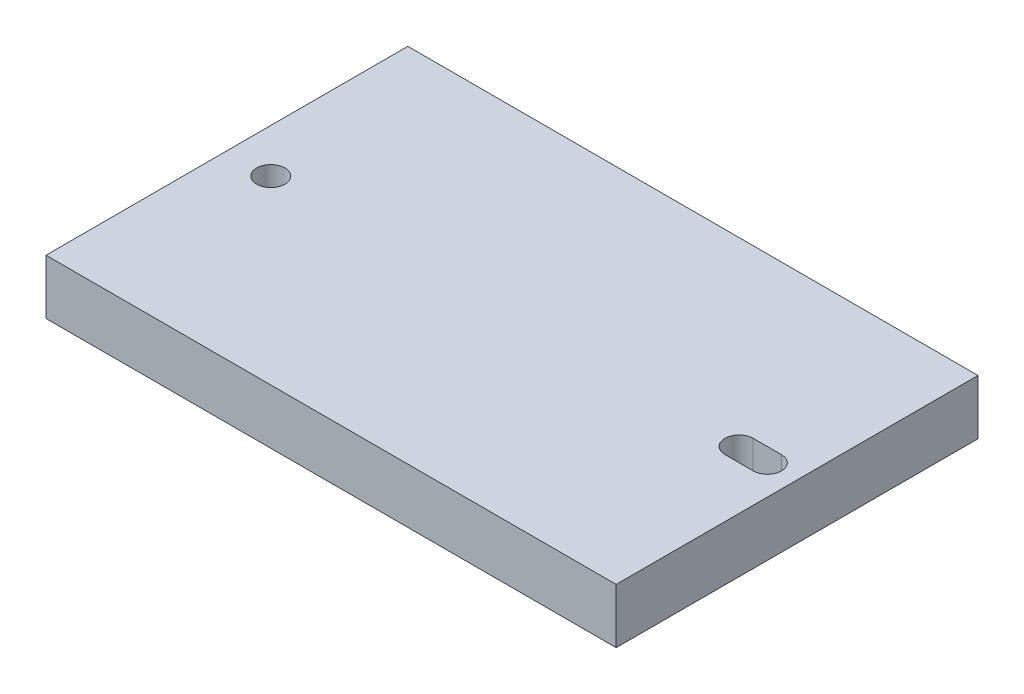
ISO-10303-21;
HEADER;
FILE_DESCRIPTION(('STEP AP214'),'2;1');
FILE_NAME('part.step','',(''),(''),'','','');
FILE_SCHEMA(('AUTOMOTIVE_DESIGN { 1 0 10303 214 1 1 1 1 }'));
ENDSEC;
DATA;
#1=APPLICATION_CONTEXT('core data for automotive mechanical design processes');
#2=APPLICATION_PROTOCOL_DEFINITION('international standard','automotive_design',2000,#1);
#3=PRODUCT_CONTEXT('',#1,'mechanical');
#4=PRODUCT('Part','Part','',(#3));
#5=PRODUCT_RELATED_PRODUCT_CATEGORY('part','',(#4));
#6=PRODUCT_DEFINITION_FORMATION('','',#4);
#7=PRODUCT_DEFINITION_CONTEXT('part definition',#1,'design');
#8=PRODUCT_DEFINITION('design','',#6,#7);
#9=PRODUCT_DEFINITION_SHAPE('','',#8);
#10=(LENGTH_UNIT() NAMED_UNIT(*) SI_UNIT(.MILLI.,.METRE.));
#11=(NAMED_UNIT(*) PLANE_ANGLE_UNIT() SI_UNIT($,.RADIAN.));
#12=(NAMED_UNIT(*) SI_UNIT($,.STERADIAN.) SOLID_ANGLE_UNIT());
#13=UNCERTAINTY_MEASURE_WITH_UNIT(LENGTH_MEASURE(1.E-05),#10,'distance_accuracy_value','');
#14=(GEOMETRIC_REPRESENTATION_CONTEXT(3) GLOBAL_UNCERTAINTY_ASSIGNED_CONTEXT((#13)) GLOBAL_UNIT_ASSIGNED_CONTEXT((#10,
#11,#12)) REPRESENTATION_CONTEXT('',''));
#15=CARTESIAN_POINT('',(0.,0.,0.));
#16=DIRECTION('',(0.,0.,1.));
#17=DIRECTION('',(1.,0.,0.));
#18=AXIS2_PLACEMENT_3D('',#15,#16,#17);
#19=CARTESIAN_POINT('',(-42.7686190505824,6.35,-22.2551637593528));
#20=DIRECTION('',(1.,0.,0.));
#21=DIRECTION('',(0.,0.,-1.));
#22=AXIS2_PLACEMENT_3D('',#19,#20,#21);
#23=PLANE('',#22);
#24=DIRECTION('',(0.,0.,1.));
#25=VECTOR('',#24,1.);
#26=CARTESIAN_POINT('',(-42.7686190505824,0.,-22.2551637593528));
#27=LINE('',#26,#25);
#28=CARTESIAN_POINT('',(-42.7686190505824,0.,-22.2551637593528));
#29=VERTEX_POINT('',#28);
#30=CARTESIAN_POINT('',(-42.7686190505824,0.,19.6548362406472));
#31=VERTEX_POINT('',#30);
#32=EDGE_CURVE('E148',#29,#31,#27,.T.);
#33=ORIENTED_EDGE('',*,*,#32,.T.);
#34=DIRECTION('',(0.,-1.,0.));
#35=VECTOR('',#34,1.);
#36=CARTESIAN_POINT('',(-42.7686190505824,6.35,19.6548362406472));
#37=LINE('',#36,#35);
#38=CARTESIAN_POINT('',(-42.7686190505824,6.35,19.6548362406472));
#39=VERTEX_POINT('',#38);
#40=EDGE_CURVE('E11',#39,#31,#37,.T.);
#41=ORIENTED_EDGE('',*,*,#40,.F.);
#42=DIRECTION('',(0.,0.,1.));
#43=VECTOR('',#42,1.);
#44=CARTESIAN_POINT('',(-42.7686190505824,6.35,-22.2551637593528));
#45=LINE('',#44,#43);
#46=CARTESIAN_POINT('',(-42.7686190505824,6.35,-22.2551637593528));
#47=VERTEX_POINT('',#46);
#48=EDGE_CURVE('E137',#47,#39,#45,.T.);
#49=ORIENTED_EDGE('',*,*,#48,.F.);
#50=DIRECTION('',(0.,-1.,0.));
#51=VECTOR('',#50,1.);
#52=CARTESIAN_POINT('',(-42.7686190505824,6.35,-22.2551637593528));
#53=LINE('',#52,#51);
#54=EDGE_CURVE('E147',#47,#29,#53,.T.);
#55=ORIENTED_EDGE('',*,*,#54,.T.);
#56=EDGE_LOOP('',(#33,#41,#49,#55));
#57=FACE_BOUND('',#56,.T.);
#58=ADVANCED_FACE('F33',(#57),#23,.F.);
#59=CARTESIAN_POINT('',(-42.7686190505824,6.35,19.6548362406472));
#60=DIRECTION('',(0.,0.,-1.));
#61=DIRECTION('',(-1.,0.,0.));
#62=AXIS2_PLACEMENT_3D('',#59,#60,#61);
#63=PLANE('',#62);
#64=DIRECTION('',(1.,0.,0.));
#65=VECTOR('',#64,1.);
#66=CARTESIAN_POINT('',(-42.7686190505824,0.,19.6548362406472));
#67=LINE('',#66,#65);
#68=CARTESIAN_POINT('',(23.2713809494176,0.,19.6548362406472));
#69=VERTEX_POINT('',#68);
#70=EDGE_CURVE('E151',#31,#69,#67,.T.);
#71=ORIENTED_EDGE('',*,*,#70,.T.);
#72=DIRECTION('',(0.,-1.,0.));
#73=VECTOR('',#72,1.);
#74=CARTESIAN_POINT('',(23.2713809494176,6.35,19.6548362406472));
#75=LINE('',#74,#73);
#76=CARTESIAN_POINT('',(23.2713809494176,6.35,19.6548362406472));
#77=VERTEX_POINT('',#76);
#78=EDGE_CURVE('E41',#77,#69,#75,.T.);
#79=ORIENTED_EDGE('',*,*,#78,.F.);
#80=DIRECTION('',(1.,0.,0.));
#81=VECTOR('',#80,1.);
#82=CARTESIAN_POINT('',(-42.7686190505824,6.35,19.6548362406472));
#83=LINE('',#82,#81);
#84=EDGE_CURVE('E140',#39,#77,#83,.T.);
#85=ORIENTED_EDGE('',*,*,#84,.F.);
#86=ORIENTED_EDGE('',*,*,#40,.T.);
#87=EDGE_LOOP('',(#71,#79,#85,#86));
#88=FACE_BOUND('',#87,.T.);
#89=ADVANCED_FACE('F181',(#88),#63,.F.);
#90=CARTESIAN_POINT('',(23.2713809494176,6.35,-22.2551637593528));
#91=DIRECTION('',(-1.,0.,0.));
#92=DIRECTION('',(0.,0.,1.));
#93=AXIS2_PLACEMENT_3D('',#90,#91,#92);
#94=PLANE('',#93);
#95=DIRECTION('',(0.,0.,-1.));
#96=VECTOR('',#95,1.);
#97=CARTESIAN_POINT('',(23.2713809494176,0.,-22.2551637593528));
#98=LINE('',#97,#96);
#99=CARTESIAN_POINT('',(23.2713809494176,0.,-22.2551637593528));
#100=VERTEX_POINT('',#99);
#101=EDGE_CURVE('E153',#69,#100,#98,.T.);
#102=ORIENTED_EDGE('',*,*,#101,.T.);
#103=DIRECTION('',(0.,-1.,0.));
#104=VECTOR('',#103,1.);
#105=CARTESIAN_POINT('',(23.2713809494176,6.35,-22.2551637593528));
#106=LINE('',#105,#104);
#107=CARTESIAN_POINT('',(23.2713809494176,6.35,-22.2551637593528));
#108=VERTEX_POINT('',#107);
#109=EDGE_CURVE('E158',#108,#100,#106,.T.);
#110=ORIENTED_EDGE('',*,*,#109,.F.);
#111=DIRECTION('',(0.,0.,-1.));
#112=VECTOR('',#111,1.);
#113=CARTESIAN_POINT('',(23.2713809494176,6.35,-22.2551637593528));
#114=LINE('',#113,#112);
#115=EDGE_CURVE('E143',#77,#108,#114,.T.);
#116=ORIENTED_EDGE('',*,*,#115,.F.);
#117=ORIENTED_EDGE('',*,*,#78,.T.);
#118=EDGE_LOOP('',(#102,#110,#116,#117));
#119=FACE_BOUND('',#118,.T.);
#120=ADVANCED_FACE('F166',(#119),#94,.F.);
#121=CARTESIAN_POINT('',(-42.7686190505824,6.35,-22.2551637593528));
#122=DIRECTION('',(0.,0.,1.));
#123=DIRECTION('',(1.,0.,0.));
#124=AXIS2_PLACEMENT_3D('',#121,#122,#123);
#125=PLANE('',#124);
#126=DIRECTION('',(-1.,0.,0.));
#127=VECTOR('',#126,1.);
#128=CARTESIAN_POINT('',(-42.7686190505824,0.,-22.2551637593528));
#129=LINE('',#128,#127);
#130=EDGE_CURVE('E141',#100,#29,#129,.T.);
#131=ORIENTED_EDGE('',*,*,#130,.T.);
#132=ORIENTED_EDGE('',*,*,#54,.F.);
#133=DIRECTION('',(-1.,0.,0.));
#134=VECTOR('',#133,1.);
#135=CARTESIAN_POINT('',(-42.7686190505824,6.35,-22.2551637593528));
#136=LINE('',#135,#134);
#137=EDGE_CURVE('E145',#108,#47,#136,.T.);
#138=ORIENTED_EDGE('',*,*,#137,.F.);
#139=ORIENTED_EDGE('',*,*,#109,.T.);
#140=EDGE_LOOP('',(#131,#132,#138,#139));
#141=FACE_BOUND('',#140,.T.);
#142=ADVANCED_FACE('F174',(#141),#125,.F.);
#143=CARTESIAN_POINT('',(-42.7686190505824,6.35,19.6548362406472));
#144=DIRECTION('',(0.,1.,0.));
#145=DIRECTION('',(0.,0.,1.));
#146=AXIS2_PLACEMENT_3D('',#143,#144,#145);
#147=PLANE('',#146);
#148=CARTESIAN_POINT('',(19.8296809494176,6.35,-1.30016375935285));
#149=DIRECTION('',(0.,1.,0.));
#150=DIRECTION('',(0.,0.,1.));
#151=AXIS2_PLACEMENT_3D('',#148,#149,#150);
#152=CIRCLE('',#151,1.63195);
#153=CARTESIAN_POINT('',(19.8296809494176,6.35,0.331786240647152));
#154=VERTEX_POINT('',#153);
#155=CARTESIAN_POINT('',(19.8296809494176,6.35,-2.93211375935285));
#156=VERTEX_POINT('',#155);
#157=EDGE_CURVE('E48',#154,#156,#152,.T.);
#158=ORIENTED_EDGE('',*,*,#157,.F.);
#159=DIRECTION('',(1.,0.,0.));
#160=VECTOR('',#159,1.);
#161=CARTESIAN_POINT('',(19.8296809494176,6.35,0.331786240647152));
#162=LINE('',#161,#160);
#163=CARTESIAN_POINT('',(16.5530809494176,6.35,0.331786240647153));
#164=VERTEX_POINT('',#163);
#165=EDGE_CURVE('E106',#164,#154,#162,.T.);
#166=ORIENTED_EDGE('',*,*,#165,.F.);
#167=CARTESIAN_POINT('',(16.5530809494176,6.35,-1.30016375935285));
#168=DIRECTION('',(0.,1.,0.));
#169=DIRECTION('',(0.,0.,1.));
#170=AXIS2_PLACEMENT_3D('',#167,#168,#169);
#171=CIRCLE('',#170,1.63195);
#172=CARTESIAN_POINT('',(16.5530809494176,6.35,-2.93211375935285));
#173=VERTEX_POINT('',#172);
#174=EDGE_CURVE('E126',#173,#164,#171,.T.);
#175=ORIENTED_EDGE('',*,*,#174,.F.);
#176=DIRECTION('',(-1.,0.,0.));
#177=VECTOR('',#176,1.);
#178=CARTESIAN_POINT('',(19.8296809494176,6.35,-2.93211375935285));
#179=LINE('',#178,#177);
#180=EDGE_CURVE('E120',#156,#173,#179,.T.);
#181=ORIENTED_EDGE('',*,*,#180,.F.);
#182=EDGE_LOOP('',(#158,#166,#175,#181));
#183=FACE_BOUND('',#182,.T.);
#184=CARTESIAN_POINT('',(-37.6886190505824,6.35,-1.30016375935284));
#185=DIRECTION('',(0.,1.,0.));
#186=DIRECTION('',(0.,0.,1.));
#187=AXIS2_PLACEMENT_3D('',#184,#185,#186);
#188=CIRCLE('',#187,1.63195);
#189=CARTESIAN_POINT('',(-37.6886190505824,6.35,0.331786240647159));
#190=VERTEX_POINT('',#189);
#191=EDGE_CURVE('E112',#190,#190,#188,.T.);
#192=ORIENTED_EDGE('',*,*,#191,.F.);
#193=EDGE_LOOP('',(#192));
#194=FACE_BOUND('',#193,.T.);
#195=ORIENTED_EDGE('',*,*,#48,.T.);
#196=ORIENTED_EDGE('',*,*,#84,.T.);
#197=ORIENTED_EDGE('',*,*,#115,.T.);
#198=ORIENTED_EDGE('',*,*,#137,.T.);
#199=EDGE_LOOP('',(#195,#196,#197,#198));
#200=FACE_BOUND('',#199,.T.);
#201=ADVANCED_FACE('F180',(#183,#194,#200),#147,.T.);
#202=CARTESIAN_POINT('',(-42.7686190505824,0.,19.6548362406472));
#203=DIRECTION('',(0.,1.,0.));
#204=DIRECTION('',(0.,0.,1.));
#205=AXIS2_PLACEMENT_3D('',#202,#203,#204);
#206=PLANE('',#205);
#207=DIRECTION('',(-1.,0.,0.));
#208=VECTOR('',#207,1.);
#209=CARTESIAN_POINT('',(19.8296809494176,0.,0.331786240647152));
#210=LINE('',#209,#208);
#211=CARTESIAN_POINT('',(19.8296809494176,0.,0.331786240647152));
#212=VERTEX_POINT('',#211);
#213=CARTESIAN_POINT('',(16.5530809494176,0.,0.331786240647153));
#214=VERTEX_POINT('',#213);
#215=EDGE_CURVE('E118',#212,#214,#210,.T.);
#216=ORIENTED_EDGE('',*,*,#215,.F.);
#217=CARTESIAN_POINT('',(19.8296809494176,0.,-1.30016375935285));
#218=DIRECTION('',(0.,1.,0.));
#219=DIRECTION('',(0.,0.,1.));
#220=AXIS2_PLACEMENT_3D('',#217,#218,#219);
#221=CIRCLE('',#220,1.63195);
#222=CARTESIAN_POINT('',(19.8296809494176,0.,-2.93211375935285));
#223=VERTEX_POINT('',#222);
#224=EDGE_CURVE('E100',#223,#212,#221,.F.);
#225=ORIENTED_EDGE('',*,*,#224,.F.);
#226=DIRECTION('',(1.,0.,0.));
#227=VECTOR('',#226,1.);
#228=CARTESIAN_POINT('',(19.8296809494176,0.,-2.93211375935285));
#229=LINE('',#228,#227);
#230=CARTESIAN_POINT('',(16.5530809494176,0.,-2.93211375935285));
#231=VERTEX_POINT('',#230);
#232=EDGE_CURVE('E109',#231,#223,#229,.T.);
#233=ORIENTED_EDGE('',*,*,#232,.F.);
#234=CARTESIAN_POINT('',(16.5530809494176,0.,-1.30016375935285));
#235=DIRECTION('',(0.,1.,0.));
#236=DIRECTION('',(0.,0.,1.));
#237=AXIS2_PLACEMENT_3D('',#234,#235,#236);
#238=CIRCLE('',#237,1.63195);
#239=EDGE_CURVE('E56',#214,#231,#238,.F.);
#240=ORIENTED_EDGE('',*,*,#239,.F.);
#241=EDGE_LOOP('',(#216,#225,#233,#240));
#242=FACE_BOUND('',#241,.T.);
#243=CARTESIAN_POINT('',(-37.6886190505824,0.,-1.30016375935284));
#244=DIRECTION('',(0.,1.,0.));
#245=DIRECTION('',(0.,0.,1.));
#246=AXIS2_PLACEMENT_3D('',#243,#244,#245);
#247=CIRCLE('',#246,1.63195);
#248=CARTESIAN_POINT('',(-37.6886190505824,0.,0.331786240647159));
#249=VERTEX_POINT('',#248);
#250=EDGE_CURVE('E36',#249,#249,#247,.T.);
#251=ORIENTED_EDGE('',*,*,#250,.T.);
#252=EDGE_LOOP('',(#251));
#253=FACE_BOUND('',#252,.T.);
#254=ORIENTED_EDGE('',*,*,#32,.F.);
#255=ORIENTED_EDGE('',*,*,#130,.F.);
#256=ORIENTED_EDGE('',*,*,#101,.F.);
#257=ORIENTED_EDGE('',*,*,#70,.F.);
#258=EDGE_LOOP('',(#254,#255,#256,#257));
#259=FACE_BOUND('',#258,.T.);
#260=ADVANCED_FACE('F115',(#242,#253,#259),#206,.F.);
#261=CARTESIAN_POINT('',(-37.6886190505824,6.35,-1.30016375935284));
#262=DIRECTION('',(0.,1.,0.));
#263=DIRECTION('',(0.,0.,1.));
#264=AXIS2_PLACEMENT_3D('',#261,#262,#263);
#265=CYLINDRICAL_SURFACE('',#264,1.63195);
#266=ORIENTED_EDGE('',*,*,#191,.T.);
#267=EDGE_LOOP('',(#266));
#268=FACE_BOUND('',#267,.T.);
#269=ORIENTED_EDGE('',*,*,#250,.F.);
#270=EDGE_LOOP('',(#269));
#271=FACE_BOUND('',#270,.T.);
#272=ADVANCED_FACE('F193',(#268,#271),#265,.F.);
#273=CARTESIAN_POINT('',(19.8296809494176,-0.00100000000000013,-1.30016375935285));
#274=DIRECTION('',(0.,1.,0.));
#275=DIRECTION('',(0.,0.,1.));
#276=AXIS2_PLACEMENT_3D('',#273,#274,#275);
#277=CYLINDRICAL_SURFACE('',#276,1.63195);
#278=ORIENTED_EDGE('',*,*,#224,.T.);
#279=DIRECTION('',(0.,1.,0.));
#280=VECTOR('',#279,1.);
#281=CARTESIAN_POINT('',(19.8296809494176,-0.00100000000000013,0.331786240647152));
#282=LINE('',#281,#280);
#283=EDGE_CURVE('E113',#212,#154,#282,.T.);
#284=ORIENTED_EDGE('',*,*,#283,.T.);
#285=ORIENTED_EDGE('',*,*,#157,.T.);
#286=DIRECTION('',(0.,1.,0.));
#287=VECTOR('',#286,1.);
#288=CARTESIAN_POINT('',(19.8296809494176,-0.00100000000000013,-2.93211375935285));
#289=LINE('',#288,#287);
#290=EDGE_CURVE('E96',#223,#156,#289,.T.);
#291=ORIENTED_EDGE('',*,*,#290,.F.);
#292=EDGE_LOOP('',(#278,#284,#285,#291));
#293=FACE_BOUND('',#292,.T.);
#294=ADVANCED_FACE('F98',(#293),#277,.F.);
#295=CARTESIAN_POINT('',(19.8296809494176,-0.00100000000000013,0.331786240647152));
#296=DIRECTION('',(0.,0.,1.));
#297=DIRECTION('',(1.,0.,0.));
#298=AXIS2_PLACEMENT_3D('',#295,#296,#297);
#299=PLANE('',#298);
#300=ORIENTED_EDGE('',*,*,#215,.T.);
#301=DIRECTION('',(0.,1.,0.));
#302=VECTOR('',#301,1.);
#303=CARTESIAN_POINT('',(16.5530809494176,-0.00100000000000013,0.331786240647153));
#304=LINE('',#303,#302);
#305=EDGE_CURVE('E132',#214,#164,#304,.T.);
#306=ORIENTED_EDGE('',*,*,#305,.T.);
#307=ORIENTED_EDGE('',*,*,#165,.T.);
#308=ORIENTED_EDGE('',*,*,#283,.F.);
#309=EDGE_LOOP('',(#300,#306,#307,#308));
#310=FACE_BOUND('',#309,.T.);
#311=ADVANCED_FACE('F202',(#310),#299,.F.);
#312=CARTESIAN_POINT('',(16.5530809494176,-0.00100000000000013,-1.30016375935285));
#313=DIRECTION('',(0.,1.,0.));
#314=DIRECTION('',(0.,0.,1.));
#315=AXIS2_PLACEMENT_3D('',#312,#313,#314);
#316=CYLINDRICAL_SURFACE('',#315,1.63195);
#317=ORIENTED_EDGE('',*,*,#239,.T.);
#318=DIRECTION('',(0.,1.,0.));
#319=VECTOR('',#318,1.);
#320=CARTESIAN_POINT('',(16.5530809494176,-0.00100000000000013,-2.93211375935285));
#321=LINE('',#320,#319);
#322=EDGE_CURVE('E105',#231,#173,#321,.T.);
#323=ORIENTED_EDGE('',*,*,#322,.T.);
#324=ORIENTED_EDGE('',*,*,#174,.T.);
#325=ORIENTED_EDGE('',*,*,#305,.F.);
#326=EDGE_LOOP('',(#317,#323,#324,#325));
#327=FACE_BOUND('',#326,.T.);
#328=ADVANCED_FACE('F205',(#327),#316,.F.);
#329=CARTESIAN_POINT('',(19.8296809494176,-0.00100000000000013,-2.93211375935285));
#330=DIRECTION('',(0.,0.,-1.));
#331=DIRECTION('',(-1.,0.,0.));
#332=AXIS2_PLACEMENT_3D('',#329,#330,#331);
#333=PLANE('',#332);
#334=ORIENTED_EDGE('',*,*,#232,.T.);
#335=ORIENTED_EDGE('',*,*,#290,.T.);
#336=ORIENTED_EDGE('',*,*,#180,.T.);
#337=ORIENTED_EDGE('',*,*,#322,.F.);
#338=EDGE_LOOP('',(#334,#335,#336,#337));
#339=FACE_BOUND('',#338,.T.);
#340=ADVANCED_FACE('F110',(#339),#333,.F.);
#341=CLOSED_SHELL('',(#58,#89,#120,#142,#201,#260,#272,#294,#311,#328,#340));
#342=MANIFOLD_SOLID_BREP('B2',#341);
#343=ADVANCED_BREP_SHAPE_REPRESENTATION('',(#18,#342),#14);
#344=SHAPE_DEFINITION_REPRESENTATION(#9,#343);
ENDSEC;
END-ISO-10303-21;
